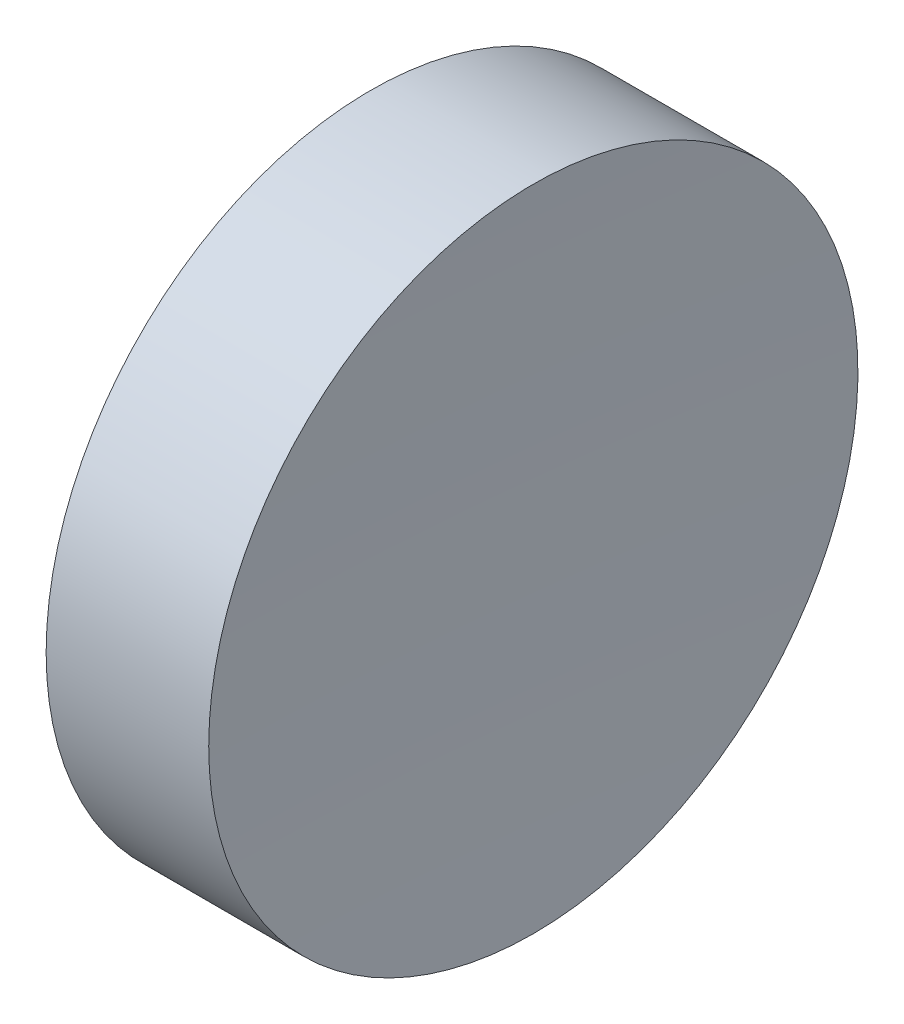
ISO-10303-21;
HEADER;
FILE_DESCRIPTION(('STEP AP214'),'2;1');
FILE_NAME('part.step','',(''),(''),'','','');
FILE_SCHEMA(('AUTOMOTIVE_DESIGN { 1 0 10303 214 1 1 1 1 }'));
ENDSEC;
DATA;
#1=APPLICATION_CONTEXT('core data for automotive mechanical design processes');
#2=APPLICATION_PROTOCOL_DEFINITION('international standard','automotive_design',2000,#1);
#3=PRODUCT_CONTEXT('',#1,'mechanical');
#4=PRODUCT('Part','Part','',(#3));
#5=PRODUCT_RELATED_PRODUCT_CATEGORY('part','',(#4));
#6=PRODUCT_DEFINITION_FORMATION('','',#4);
#7=PRODUCT_DEFINITION_CONTEXT('part definition',#1,'design');
#8=PRODUCT_DEFINITION('design','',#6,#7);
#9=PRODUCT_DEFINITION_SHAPE('','',#8);
#10=(LENGTH_UNIT() NAMED_UNIT(*) SI_UNIT(.MILLI.,.METRE.));
#11=(NAMED_UNIT(*) PLANE_ANGLE_UNIT() SI_UNIT($,.RADIAN.));
#12=(NAMED_UNIT(*) SI_UNIT($,.STERADIAN.) SOLID_ANGLE_UNIT());
#13=UNCERTAINTY_MEASURE_WITH_UNIT(LENGTH_MEASURE(1.E-05),#10,'distance_accuracy_value','');
#14=(GEOMETRIC_REPRESENTATION_CONTEXT(3) GLOBAL_UNCERTAINTY_ASSIGNED_CONTEXT((#13)) GLOBAL_UNIT_ASSIGNED_CONTEXT((#10,
#11,#12)) REPRESENTATION_CONTEXT('',''));
#15=CARTESIAN_POINT('',(0.,0.,0.));
#16=DIRECTION('',(0.,0.,1.));
#17=DIRECTION('',(1.,0.,0.));
#18=AXIS2_PLACEMENT_3D('',#15,#16,#17);
#19=CARTESIAN_POINT('',(210.546327596363,34.6890105616862,0.));
#20=DIRECTION('',(-1.,0.,0.));
#21=DIRECTION('',(0.,-1.,0.));
#22=AXIS2_PLACEMENT_3D('',#19,#20,#21);
#23=SPHERICAL_SURFACE('',#22,150.);
#24=CARTESIAN_POINT('',(60.6765924928401,34.6890105616862,0.));
#25=DIRECTION('',(-1.,0.,0.));
#26=DIRECTION('',(0.,0.,1.));
#27=AXIS2_PLACEMENT_3D('',#24,#25,#26);
#28=CIRCLE('',#27,6.25000000000001);
#29=CARTESIAN_POINT('',(60.6765924928401,34.6890105616862,6.25000000000001));
#30=VERTEX_POINT('',#29);
#31=EDGE_CURVE('E10',#30,#30,#28,.T.);
#32=ORIENTED_EDGE('',*,*,#31,.F.);
#33=EDGE_LOOP('',(#32));
#34=FACE_BOUND('',#33,.T.);
#35=ADVANCED_FACE('F35',(#34),#23,.F.);
#36=CARTESIAN_POINT('',(54.4925715010826,34.6890105616862,0.));
#37=DIRECTION('',(-1.,0.,0.));
#38=DIRECTION('',(0.,0.,1.));
#39=AXIS2_PLACEMENT_3D('',#36,#37,#38);
#40=CYLINDRICAL_SURFACE('',#39,6.25000000000001);
#41=CARTESIAN_POINT('',(57.5463277674598,34.6890105616862,0.));
#42=DIRECTION('',(-1.,0.,0.));
#43=DIRECTION('',(0.,0.,1.));
#44=AXIS2_PLACEMENT_3D('',#41,#42,#43);
#45=CIRCLE('',#44,6.25);
#46=CARTESIAN_POINT('',(57.5463277674598,34.6890105616862,6.25));
#47=VERTEX_POINT('',#46);
#48=EDGE_CURVE('E41',#47,#47,#45,.T.);
#49=ORIENTED_EDGE('',*,*,#48,.F.);
#50=EDGE_LOOP('',(#49));
#51=FACE_BOUND('',#50,.T.);
#52=ORIENTED_EDGE('',*,*,#31,.T.);
#53=EDGE_LOOP('',(#52));
#54=FACE_BOUND('',#53,.T.);
#55=ADVANCED_FACE('F49',(#51,#54),#40,.T.);
#56=CARTESIAN_POINT('',(57.5463277674598,34.6890105616862,0.));
#57=DIRECTION('',(1.,0.,0.));
#58=DIRECTION('',(0.,0.,-1.));
#59=AXIS2_PLACEMENT_3D('',#56,#57,#58);
#60=PLANE('',#59);
#61=ORIENTED_EDGE('',*,*,#48,.T.);
#62=EDGE_LOOP('',(#61));
#63=FACE_BOUND('',#62,.T.);
#64=ADVANCED_FACE('F47',(#63),#60,.F.);
#65=CLOSED_SHELL('',(#35,#55,#64));
#66=MANIFOLD_SOLID_BREP('B2',#65);
#67=ADVANCED_BREP_SHAPE_REPRESENTATION('',(#18,#66),#14);
#68=SHAPE_DEFINITION_REPRESENTATION(#9,#67);
ENDSEC;
END-ISO-10303-21;
